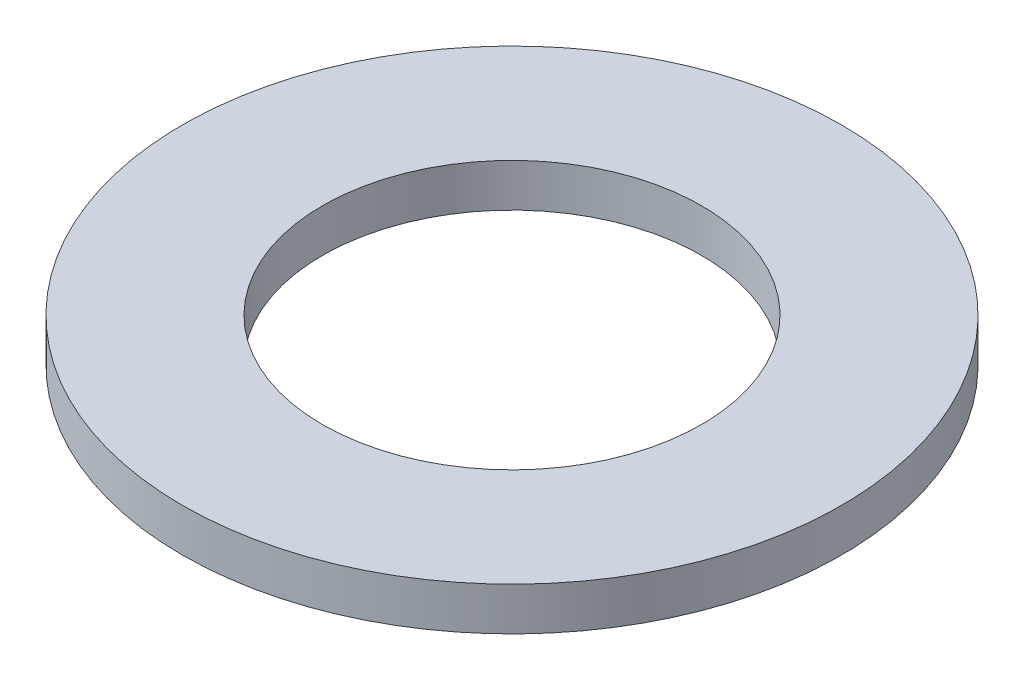
ISO-10303-21;
HEADER;
FILE_DESCRIPTION(('STEP AP214'),'2;1');
FILE_NAME('part.step','',(''),(''),'','','');
FILE_SCHEMA(('AUTOMOTIVE_DESIGN { 1 0 10303 214 1 1 1 1 }'));
ENDSEC;
DATA;
#1=APPLICATION_CONTEXT('core data for automotive mechanical design processes');
#2=APPLICATION_PROTOCOL_DEFINITION('international standard','automotive_design',2000,#1);
#3=PRODUCT_CONTEXT('',#1,'mechanical');
#4=PRODUCT('Part','Part','',(#3));
#5=PRODUCT_RELATED_PRODUCT_CATEGORY('part','',(#4));
#6=PRODUCT_DEFINITION_FORMATION('','',#4);
#7=PRODUCT_DEFINITION_CONTEXT('part definition',#1,'design');
#8=PRODUCT_DEFINITION('design','',#6,#7);
#9=PRODUCT_DEFINITION_SHAPE('','',#8);
#10=(LENGTH_UNIT() NAMED_UNIT(*) SI_UNIT(.MILLI.,.METRE.));
#11=(NAMED_UNIT(*) PLANE_ANGLE_UNIT() SI_UNIT($,.RADIAN.));
#12=(NAMED_UNIT(*) SI_UNIT($,.STERADIAN.) SOLID_ANGLE_UNIT());
#13=UNCERTAINTY_MEASURE_WITH_UNIT(LENGTH_MEASURE(1.E-05),#10,'distance_accuracy_value','');
#14=(GEOMETRIC_REPRESENTATION_CONTEXT(3) GLOBAL_UNCERTAINTY_ASSIGNED_CONTEXT((#13)) GLOBAL_UNIT_ASSIGNED_CONTEXT((#10,
#11,#12)) REPRESENTATION_CONTEXT('',''));
#15=CARTESIAN_POINT('',(0.,0.,0.));
#16=DIRECTION('',(0.,0.,1.));
#17=DIRECTION('',(1.,0.,0.));
#18=AXIS2_PLACEMENT_3D('',#15,#16,#17);
#19=CARTESIAN_POINT('',(0.,0.254,0.));
#20=DIRECTION('',(0.,-1.,0.));
#21=DIRECTION('',(0.,0.,-1.));
#22=AXIS2_PLACEMENT_3D('',#19,#20,#21);
#23=CYLINDRICAL_SURFACE('',#22,1.9431);
#24=CARTESIAN_POINT('',(0.,0.254,0.));
#25=DIRECTION('',(0.,1.,0.));
#26=DIRECTION('',(0.,0.,1.));
#27=AXIS2_PLACEMENT_3D('',#24,#25,#26);
#28=CIRCLE('',#27,1.9431);
#29=CARTESIAN_POINT('',(0.,0.254,1.9431));
#30=VERTEX_POINT('',#29);
#31=EDGE_CURVE('E10',#30,#30,#28,.T.);
#32=ORIENTED_EDGE('',*,*,#31,.F.);
#33=EDGE_LOOP('',(#32));
#34=FACE_BOUND('',#33,.T.);
#35=CARTESIAN_POINT('',(0.,0.,0.));
#36=DIRECTION('',(0.,1.,0.));
#37=DIRECTION('',(0.,0.,1.));
#38=AXIS2_PLACEMENT_3D('',#35,#36,#37);
#39=CIRCLE('',#38,1.9431);
#40=CARTESIAN_POINT('',(0.,0.,1.9431));
#41=VERTEX_POINT('',#40);
#42=EDGE_CURVE('E36',#41,#41,#39,.T.);
#43=ORIENTED_EDGE('',*,*,#42,.T.);
#44=EDGE_LOOP('',(#43));
#45=FACE_BOUND('',#44,.T.);
#46=ADVANCED_FACE('F33',(#34,#45),#23,.T.);
#47=CARTESIAN_POINT('',(0.,0.254,0.));
#48=DIRECTION('',(0.,1.,0.));
#49=DIRECTION('',(0.,0.,1.));
#50=AXIS2_PLACEMENT_3D('',#47,#48,#49);
#51=PLANE('',#50);
#52=CARTESIAN_POINT('',(0.,0.254,0.));
#53=DIRECTION('',(0.,1.,0.));
#54=DIRECTION('',(0.,0.,1.));
#55=AXIS2_PLACEMENT_3D('',#52,#53,#54);
#56=CIRCLE('',#55,1.1176);
#57=CARTESIAN_POINT('',(0.,0.254,1.1176));
#58=VERTEX_POINT('',#57);
#59=EDGE_CURVE('E45',#58,#58,#56,.T.);
#60=ORIENTED_EDGE('',*,*,#59,.F.);
#61=EDGE_LOOP('',(#60));
#62=FACE_BOUND('',#61,.T.);
#63=ORIENTED_EDGE('',*,*,#31,.T.);
#64=EDGE_LOOP('',(#63));
#65=FACE_BOUND('',#64,.T.);
#66=ADVANCED_FACE('F60',(#62,#65),#51,.T.);
#67=CARTESIAN_POINT('',(0.,0.,0.));
#68=DIRECTION('',(0.,1.,0.));
#69=DIRECTION('',(0.,0.,1.));
#70=AXIS2_PLACEMENT_3D('',#67,#68,#69);
#71=PLANE('',#70);
#72=CARTESIAN_POINT('',(0.,0.,0.));
#73=DIRECTION('',(0.,1.,0.));
#74=DIRECTION('',(0.,0.,1.));
#75=AXIS2_PLACEMENT_3D('',#72,#73,#74);
#76=CIRCLE('',#75,1.1176);
#77=CARTESIAN_POINT('',(0.,0.,1.1176));
#78=VERTEX_POINT('',#77);
#79=EDGE_CURVE('E43',#78,#78,#76,.T.);
#80=ORIENTED_EDGE('',*,*,#79,.T.);
#81=EDGE_LOOP('',(#80));
#82=FACE_BOUND('',#81,.T.);
#83=ORIENTED_EDGE('',*,*,#42,.F.);
#84=EDGE_LOOP('',(#83));
#85=FACE_BOUND('',#84,.T.);
#86=ADVANCED_FACE('F51',(#82,#85),#71,.F.);
#87=CARTESIAN_POINT('',(0.,0.,0.));
#88=DIRECTION('',(0.,1.,0.));
#89=DIRECTION('',(0.,0.,1.));
#90=AXIS2_PLACEMENT_3D('',#87,#88,#89);
#91=CYLINDRICAL_SURFACE('',#90,1.1176);
#92=ORIENTED_EDGE('',*,*,#79,.F.);
#93=EDGE_LOOP('',(#92));
#94=FACE_BOUND('',#93,.T.);
#95=ORIENTED_EDGE('',*,*,#59,.T.);
#96=EDGE_LOOP('',(#95));
#97=FACE_BOUND('',#96,.T.);
#98=ADVANCED_FACE('F54',(#94,#97),#91,.F.);
#99=CLOSED_SHELL('',(#46,#66,#86,#98));
#100=MANIFOLD_SOLID_BREP('B2',#99);
#101=ADVANCED_BREP_SHAPE_REPRESENTATION('',(#18,#100),#14);
#102=SHAPE_DEFINITION_REPRESENTATION(#9,#101);
ENDSEC;
END-ISO-10303-21;
